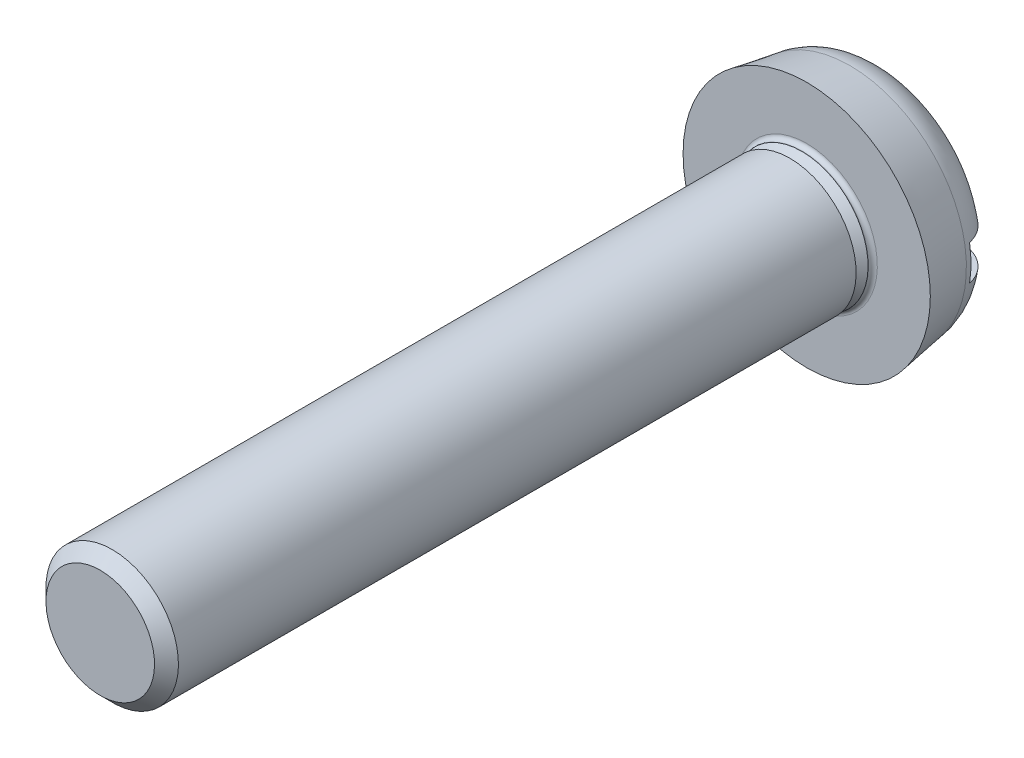
ISO-10303-21;
HEADER;
FILE_DESCRIPTION(('STEP AP214'),'2;1');
FILE_NAME('part.step','',(''),(''),'','','');
FILE_SCHEMA(('AUTOMOTIVE_DESIGN { 1 0 10303 214 1 1 1 1 }'));
ENDSEC;
DATA;
#1=APPLICATION_CONTEXT('core data for automotive mechanical design processes');
#2=APPLICATION_PROTOCOL_DEFINITION('international standard','automotive_design',2000,#1);
#3=PRODUCT_CONTEXT('',#1,'mechanical');
#4=PRODUCT('Part','Part','',(#3));
#5=PRODUCT_RELATED_PRODUCT_CATEGORY('part','',(#4));
#6=PRODUCT_DEFINITION_FORMATION('','',#4);
#7=PRODUCT_DEFINITION_CONTEXT('part definition',#1,'design');
#8=PRODUCT_DEFINITION('design','',#6,#7);
#9=PRODUCT_DEFINITION_SHAPE('','',#8);
#10=(LENGTH_UNIT() NAMED_UNIT(*) SI_UNIT(.MILLI.,.METRE.));
#11=(NAMED_UNIT(*) PLANE_ANGLE_UNIT() SI_UNIT($,.RADIAN.));
#12=(NAMED_UNIT(*) SI_UNIT($,.STERADIAN.) SOLID_ANGLE_UNIT());
#13=UNCERTAINTY_MEASURE_WITH_UNIT(LENGTH_MEASURE(1.E-05),#10,'distance_accuracy_value','');
#14=(GEOMETRIC_REPRESENTATION_CONTEXT(3) GLOBAL_UNCERTAINTY_ASSIGNED_CONTEXT((#13)) GLOBAL_UNIT_ASSIGNED_CONTEXT((#10,
#11,#12)) REPRESENTATION_CONTEXT('',''));
#15=CARTESIAN_POINT('',(0.,0.,0.));
#16=DIRECTION('',(0.,0.,1.));
#17=DIRECTION('',(1.,0.,0.));
#18=AXIS2_PLACEMENT_3D('',#15,#16,#17);
#19=CARTESIAN_POINT('',(0.,0.6146875,17.8));
#20=DIRECTION('',(0.,0.,1.));
#21=DIRECTION('',(0.,1.,0.));
#22=AXIS2_PLACEMENT_3D('',#19,#20,#21);
#23=PLANE('',#22);
#24=CARTESIAN_POINT('',(0.,0.,17.8));
#25=DIRECTION('',(0.,0.,1.));
#26=DIRECTION('',(0.,1.,0.));
#27=AXIS2_PLACEMENT_3D('',#24,#25,#26);
#28=CIRCLE('',#27,1.229375);
#29=CARTESIAN_POINT('',(0.,1.229375,17.8));
#30=VERTEX_POINT('',#29);
#31=EDGE_CURVE('E11',#30,#30,#28,.T.);
#32=ORIENTED_EDGE('',*,*,#31,.T.);
#33=EDGE_LOOP('',(#32));
#34=FACE_BOUND('',#33,.T.);
#35=ADVANCED_FACE('F16',(#34),#23,.T.);
#36=CARTESIAN_POINT('',(0.,0.,17.6646875));
#37=DIRECTION('',(0.,0.,-1.));
#38=DIRECTION('',(0.,1.,0.));
#39=AXIS2_PLACEMENT_3D('',#36,#37,#38);
#40=CONICAL_SURFACE('',#39,1.3646875,0.78539816339745);
#41=CARTESIAN_POINT('',(0.,0.,17.529375));
#42=DIRECTION('',(0.,0.,1.));
#43=DIRECTION('',(0.,1.,0.));
#44=AXIS2_PLACEMENT_3D('',#41,#42,#43);
#45=CIRCLE('',#44,1.5);
#46=CARTESIAN_POINT('',(0.,1.5,17.529375));
#47=VERTEX_POINT('',#46);
#48=EDGE_CURVE('E28',#47,#47,#45,.T.);
#49=ORIENTED_EDGE('',*,*,#48,.T.);
#50=EDGE_LOOP('',(#49));
#51=FACE_BOUND('',#50,.T.);
#52=ORIENTED_EDGE('',*,*,#31,.F.);
#53=EDGE_LOOP('',(#52));
#54=FACE_BOUND('',#53,.T.);
#55=ADVANCED_FACE('F177',(#51,#54),#40,.T.);
#56=CARTESIAN_POINT('',(0.,0.,9.855));
#57=DIRECTION('',(0.,0.,-1.));
#58=DIRECTION('',(0.,1.,0.));
#59=AXIS2_PLACEMENT_3D('',#56,#57,#58);
#60=CYLINDRICAL_SURFACE('',#59,1.5);
#61=CARTESIAN_POINT('',(0.,0.,2.180625));
#62=DIRECTION('',(0.,0.,1.));
#63=DIRECTION('',(0.,1.,0.));
#64=AXIS2_PLACEMENT_3D('',#61,#62,#63);
#65=CIRCLE('',#64,1.5);
#66=CARTESIAN_POINT('',(0.,1.5,2.180625));
#67=VERTEX_POINT('',#66);
#68=EDGE_CURVE('E71',#67,#67,#65,.T.);
#69=ORIENTED_EDGE('',*,*,#68,.T.);
#70=EDGE_LOOP('',(#69));
#71=FACE_BOUND('',#70,.T.);
#72=ORIENTED_EDGE('',*,*,#48,.F.);
#73=EDGE_LOOP('',(#72));
#74=FACE_BOUND('',#73,.T.);
#75=ADVANCED_FACE('F72',(#71,#74),#60,.T.);
#76=CARTESIAN_POINT('',(0.,1.3646875,2.180625));
#77=DIRECTION('',(0.,0.,-1.));
#78=DIRECTION('',(0.,-1.,0.));
#79=AXIS2_PLACEMENT_3D('',#76,#77,#78);
#80=PLANE('',#79);
#81=CARTESIAN_POINT('',(0.,0.,2.180625));
#82=DIRECTION('',(0.,0.,1.));
#83=DIRECTION('',(0.,1.,0.));
#84=AXIS2_PLACEMENT_3D('',#81,#82,#83);
#85=CIRCLE('',#84,1.229375);
#86=CARTESIAN_POINT('',(0.,1.229375,2.180625));
#87=VERTEX_POINT('',#86);
#88=EDGE_CURVE('E75',#87,#87,#85,.T.);
#89=ORIENTED_EDGE('',*,*,#88,.T.);
#90=EDGE_LOOP('',(#89));
#91=FACE_BOUND('',#90,.T.);
#92=ORIENTED_EDGE('',*,*,#68,.F.);
#93=EDGE_LOOP('',(#92));
#94=FACE_BOUND('',#93,.T.);
#95=ADVANCED_FACE('F129',(#91,#94),#80,.T.);
#96=CARTESIAN_POINT('',(0.,0.,2.0453125));
#97=DIRECTION('',(0.,0.,-1.));
#98=DIRECTION('',(0.,1.,0.));
#99=AXIS2_PLACEMENT_3D('',#96,#97,#98);
#100=CONICAL_SURFACE('',#99,1.3646875,0.785398163397448);
#101=CARTESIAN_POINT('',(0.,0.,1.91));
#102=DIRECTION('',(0.,0.,1.));
#103=DIRECTION('',(0.,1.,0.));
#104=AXIS2_PLACEMENT_3D('',#101,#102,#103);
#105=CIRCLE('',#104,1.5);
#106=CARTESIAN_POINT('',(0.,1.5,1.91));
#107=VERTEX_POINT('',#106);
#108=EDGE_CURVE('E78',#107,#107,#105,.T.);
#109=ORIENTED_EDGE('',*,*,#108,.T.);
#110=EDGE_LOOP('',(#109));
#111=FACE_BOUND('',#110,.T.);
#112=ORIENTED_EDGE('',*,*,#88,.F.);
#113=EDGE_LOOP('',(#112));
#114=FACE_BOUND('',#113,.T.);
#115=ADVANCED_FACE('F175',(#111,#114),#100,.T.);
#116=CARTESIAN_POINT('',(0.,0.,1.905));
#117=DIRECTION('',(0.,0.,-1.));
#118=DIRECTION('',(0.,1.,0.));
#119=AXIS2_PLACEMENT_3D('',#116,#117,#118);
#120=CYLINDRICAL_SURFACE('',#119,1.5);
#121=CARTESIAN_POINT('',(0.,0.,1.9));
#122=DIRECTION('',(0.,0.,1.));
#123=DIRECTION('',(0.,1.,0.));
#124=AXIS2_PLACEMENT_3D('',#121,#122,#123);
#125=CIRCLE('',#124,1.5);
#126=CARTESIAN_POINT('',(0.,1.5,1.9));
#127=VERTEX_POINT('',#126);
#128=EDGE_CURVE('E82',#127,#127,#125,.T.);
#129=ORIENTED_EDGE('',*,*,#128,.T.);
#130=EDGE_LOOP('',(#129));
#131=FACE_BOUND('',#130,.T.);
#132=ORIENTED_EDGE('',*,*,#108,.F.);
#133=EDGE_LOOP('',(#132));
#134=FACE_BOUND('',#133,.T.);
#135=ADVANCED_FACE('F170',(#131,#134),#120,.T.);
#136=CARTESIAN_POINT('',(0.,0.,1.9));
#137=DIRECTION('',(0.,0.,1.));
#138=DIRECTION('',(1.,0.,0.));
#139=AXIS2_PLACEMENT_3D('',#136,#137,#138);
#140=TOROIDAL_SURFACE('',#139,1.6,0.1);
#141=CARTESIAN_POINT('',(0.,0.,1.8));
#142=DIRECTION('',(0.,0.,1.));
#143=DIRECTION('',(0.,1.,0.));
#144=AXIS2_PLACEMENT_3D('',#141,#142,#143);
#145=CIRCLE('',#144,1.6);
#146=CARTESIAN_POINT('',(0.,1.6,1.8));
#147=VERTEX_POINT('',#146);
#148=EDGE_CURVE('E250',#147,#147,#145,.T.);
#149=ORIENTED_EDGE('',*,*,#148,.T.);
#150=EDGE_LOOP('',(#149));
#151=FACE_BOUND('',#150,.T.);
#152=ORIENTED_EDGE('',*,*,#128,.F.);
#153=EDGE_LOOP('',(#152));
#154=FACE_BOUND('',#153,.T.);
#155=ADVANCED_FACE('F174',(#151,#154),#140,.F.);
#156=CARTESIAN_POINT('',(0.,2.2,1.8));
#157=DIRECTION('',(0.,0.,1.));
#158=DIRECTION('',(0.,1.,0.));
#159=AXIS2_PLACEMENT_3D('',#156,#157,#158);
#160=PLANE('',#159);
#161=CARTESIAN_POINT('',(0.,0.,1.8));
#162=DIRECTION('',(0.,0.,1.));
#163=DIRECTION('',(0.,1.,0.));
#164=AXIS2_PLACEMENT_3D('',#161,#162,#163);
#165=CIRCLE('',#164,2.8);
#166=CARTESIAN_POINT('',(0.,2.8,1.8));
#167=VERTEX_POINT('',#166);
#168=EDGE_CURVE('E249',#167,#167,#165,.T.);
#169=ORIENTED_EDGE('',*,*,#168,.T.);
#170=EDGE_LOOP('',(#169));
#171=FACE_BOUND('',#170,.T.);
#172=ORIENTED_EDGE('',*,*,#148,.F.);
#173=EDGE_LOOP('',(#172));
#174=FACE_BOUND('',#173,.T.);
#175=ADVANCED_FACE('F229',(#171,#174),#160,.T.);
#176=CARTESIAN_POINT('',(0.,0.,1.31077991576355));
#177=DIRECTION('',(0.,0.,1.));
#178=DIRECTION('',(0.,1.,0.));
#179=AXIS2_PLACEMENT_3D('',#176,#177,#178);
#180=CONICAL_SURFACE('',#179,2.71954781696795,0.162991029402412);
#181=CARTESIAN_POINT('',(0.,0.,0.821559831527108));
#182=DIRECTION('',(0.,0.,1.));
#183=DIRECTION('',(0.,1.,0.));
#184=AXIS2_PLACEMENT_3D('',#181,#182,#183);
#185=CIRCLE('',#184,2.63909563393591);
#186=CARTESIAN_POINT('',(0.,2.63909563393591,0.821559831527108));
#187=VERTEX_POINT('',#186);
#188=EDGE_CURVE('E209',#187,#187,#185,.T.);
#189=ORIENTED_EDGE('',*,*,#188,.T.);
#190=EDGE_LOOP('',(#189));
#191=FACE_BOUND('',#190,.T.);
#192=ORIENTED_EDGE('',*,*,#168,.F.);
#193=EDGE_LOOP('',(#192));
#194=FACE_BOUND('',#193,.T.);
#195=ADVANCED_FACE('F233',(#191,#194),#180,.T.);
#196=CARTESIAN_POINT('',(0.,0.871260202826668,0.));
#197=DIRECTION('',(0.,0.,-1.));
#198=DIRECTION('',(0.,-1.,0.));
#199=AXIS2_PLACEMENT_3D('',#196,#197,#198);
#200=PLANE('',#199);
#201=DIRECTION('',(1.,0.,0.));
#202=VECTOR('',#201,1.);
#203=CARTESIAN_POINT('',(0.,-0.4,0.));
#204=LINE('',#203,#202);
#205=CARTESIAN_POINT('',(-1.69598860966643,-0.4,0.));
#206=VERTEX_POINT('',#205);
#207=CARTESIAN_POINT('',(1.69598860966643,-0.4,0.));
#208=VERTEX_POINT('',#207);
#209=EDGE_CURVE('E202',#206,#208,#204,.T.);
#210=ORIENTED_EDGE('',*,*,#209,.T.);
#211=CARTESIAN_POINT('',(0.,0.,0.));
#212=DIRECTION('',(0.,0.,1.));
#213=DIRECTION('',(0.,1.,0.));
#214=AXIS2_PLACEMENT_3D('',#211,#212,#213);
#215=CIRCLE('',#214,1.74252040565333);
#216=EDGE_CURVE('E86',#206,#208,#215,.T.);
#217=ORIENTED_EDGE('',*,*,#216,.F.);
#218=EDGE_LOOP('',(#210,#217));
#219=FACE_BOUND('',#218,.T.);
#220=ADVANCED_FACE('F238',(#219),#200,.T.);
#221=CARTESIAN_POINT('',(0.,0.871260202826668,0.));
#222=DIRECTION('',(0.,0.,-1.));
#223=DIRECTION('',(0.,-1.,0.));
#224=AXIS2_PLACEMENT_3D('',#221,#222,#223);
#225=PLANE('',#224);
#226=DIRECTION('',(-1.,0.,0.));
#227=VECTOR('',#226,1.);
#228=CARTESIAN_POINT('',(0.,0.4,0.));
#229=LINE('',#228,#227);
#230=CARTESIAN_POINT('',(1.69598860966643,0.4,0.));
#231=VERTEX_POINT('',#230);
#232=CARTESIAN_POINT('',(-1.69598860966643,0.4,0.));
#233=VERTEX_POINT('',#232);
#234=EDGE_CURVE('E201',#231,#233,#229,.T.);
#235=ORIENTED_EDGE('',*,*,#234,.T.);
#236=CARTESIAN_POINT('',(0.,0.,0.));
#237=DIRECTION('',(0.,0.,1.));
#238=DIRECTION('',(0.,1.,0.));
#239=AXIS2_PLACEMENT_3D('',#236,#237,#238);
#240=CIRCLE('',#239,1.74252040565333);
#241=EDGE_CURVE('E199',#231,#233,#240,.T.);
#242=ORIENTED_EDGE('',*,*,#241,.F.);
#243=EDGE_LOOP('',(#235,#242));
#244=FACE_BOUND('',#243,.T.);
#245=ADVANCED_FACE('F18',(#244),#225,.T.);
#246=CARTESIAN_POINT('',(0.,0.,0.9));
#247=DIRECTION('',(0.,0.,1.));
#248=DIRECTION('',(1.,0.,0.));
#249=AXIS2_PLACEMENT_3D('',#246,#247,#248);
#250=TOROIDAL_SURFACE('',#249,1.74252040565333,0.9);
#251=ORIENTED_EDGE('',*,*,#188,.F.);
#252=EDGE_LOOP('',(#251));
#253=FACE_BOUND('',#252,.T.);
#254=CARTESIAN_POINT('',(-2.58930232459963,-0.400002310663471,0.700000093620661));
#255=CARTESIAN_POINT('',(-2.58603016384791,-0.400004445378837,0.685811851401637));
#256=CARTESIAN_POINT('',(-2.58240980288171,-0.400004404648168,0.671703973825827));
#257=CARTESIAN_POINT('',(-2.57451556003029,-0.400001225895553,0.64379773863432));
#258=CARTESIAN_POINT('',(-2.57024730625734,-0.399998113386262,0.629997788758489));
#259=CARTESIAN_POINT('',(-2.56108386584159,-0.399990072352411,0.602734435759247));
#260=CARTESIAN_POINT('',(-2.55619414715188,-0.399985159035877,0.589269194565762));
#261=CARTESIAN_POINT('',(-2.54581566471475,-0.399974533465738,0.562700061286046));
#262=CARTESIAN_POINT('',(-2.54033219664919,-0.399968828164645,0.549594100311867));
#263=CARTESIAN_POINT('',(-2.52879467482801,-0.399957442275121,0.523766294406887));
#264=CARTESIAN_POINT('',(-2.52274573838059,-0.399951761875004,0.51104216325388));
#265=CARTESIAN_POINT('',(-2.51010632936987,-0.399941056241199,0.485998719717618));
#266=CARTESIAN_POINT('',(-2.50352078948981,-0.399936025942421,0.473676917519679));
#267=CARTESIAN_POINT('',(-2.48983764111567,-0.399927077949983,0.449456808761247));
#268=CARTESIAN_POINT('',(-2.48274477581483,-0.39992315130314,0.437555822230551));
#269=CARTESIAN_POINT('',(-2.46807674734359,-0.399916710919099,0.414194025157023));
#270=CARTESIAN_POINT('',(-2.46050613388774,-0.399914185595139,0.402730357692553));
#271=CARTESIAN_POINT('',(-2.44491256052025,-0.399910708739053,0.380257922331634));
#272=CARTESIAN_POINT('',(-2.43689395376447,-0.399909744114387,0.369246133452677));
#273=CARTESIAN_POINT('',(-2.42043441297166,-0.399909427768705,0.347690266360427));
#274=CARTESIAN_POINT('',(-2.41199763325036,-0.399910062450045,0.337143015655555));
#275=CARTESIAN_POINT('',(-2.39473172574231,-0.399912879900166,0.316527173193073));
#276=CARTESIAN_POINT('',(-2.38590655187944,-0.399915049436982,0.306455269621401));
#277=CARTESIAN_POINT('',(-2.36789369411513,-0.39992078558915,0.286799261016866));
#278=CARTESIAN_POINT('',(-2.35870976284898,-0.399924340078451,0.277211716654721));
#279=CARTESIAN_POINT('',(-2.3400089920985,-0.399932626429048,0.258531815521256));
#280=CARTESIAN_POINT('',(-2.33049570365215,-0.3999373478799,0.249435903326361));
#281=CARTESIAN_POINT('',(-2.31116549544524,-0.399947696846867,0.231744966673539));
#282=CARTESIAN_POINT('',(-2.30135192534285,-0.399953316148124,0.223146281732119));
#283=CARTESIAN_POINT('',(-2.28145002336425,-0.39996515447717,0.206453875453827));
#284=CARTESIAN_POINT('',(-2.27136484045451,-0.399971367837367,0.198356399226376));
#285=CARTESIAN_POINT('',(-2.25094809880811,-0.399984068833167,0.182668929108262));
#286=CARTESIAN_POINT('',(-2.24061948945558,-0.39999055357373,0.175075096200253));
#287=CARTESIAN_POINT('',(-2.21974372718398,-0.400003467933913,0.160395943523096));
#288=CARTESIAN_POINT('',(-2.20919932555431,-0.400009897532228,0.15330671052952));
#289=CARTESIAN_POINT('',(-2.18791919324446,-0.400022382591445,0.139636371387922));
#290=CARTESIAN_POINT('',(-2.17718601758761,-0.400028440884483,0.133051287381121));
#291=CARTESIAN_POINT('',(-2.15555487584855,-0.400039888103823,0.120387514879533));
#292=CARTESIAN_POINT('',(-2.14465927066184,-0.400045282576831,0.114304793131935));
#293=CARTESIAN_POINT('',(-2.12272908021936,-0.400055143141028,0.102642741664363));
#294=CARTESIAN_POINT('',(-2.11169666415282,-0.400059617239203,0.0970593322200856));
#295=CARTESIAN_POINT('',(-2.08951788726964,-0.40006742565004,0.0863917030851215));
#296=CARTESIAN_POINT('',(-2.07837350661909,-0.400070770063668,0.0813033658174739));
#297=CARTESIAN_POINT('',(-2.0559950195168,-0.400076165642902,0.0716205534654186));
#298=CARTESIAN_POINT('',(-2.04476270713511,-0.4000782285288,0.0670219312795501));
#299=CARTESIAN_POINT('',(-2.02223172306731,-0.400080974766746,0.0583121695365562));
#300=CARTESIAN_POINT('',(-2.01093466251196,-0.400081670879314,0.0541968614025229));
#301=CARTESIAN_POINT('',(-1.98829666511221,-0.400081672589585,0.0464463690545487));
#302=CARTESIAN_POINT('',(-1.97695715983429,-0.400080991308666,0.0428070025681866));
#303=CARTESIAN_POINT('',(-1.95425584634926,-0.400078309561493,0.0360001277627895));
#304=CARTESIAN_POINT('',(-1.94289529372838,-0.400076321802372,0.0328284309945193));
#305=CARTESIAN_POINT('',(-1.92017252770733,-0.400071186659841,0.0269477938547178));
#306=CARTESIAN_POINT('',(-1.90881139769879,-0.400068050703004,0.0242346661217626));
#307=CARTESIAN_POINT('',(-1.88610717078177,-0.400060871679835,0.0192612994111576));
#308=CARTESIAN_POINT('',(-1.87476498905065,-0.40005683780804,0.016996881171664));
#309=CARTESIAN_POINT('',(-1.85211739117859,-0.400048212428999,0.0129103674199857));
#310=CARTESIAN_POINT('',(-1.84081272617266,-0.400043626849462,0.0110841075194339));
#311=CARTESIAN_POINT('',(-1.81825792467539,-0.400034346102312,0.00786271647858093));
#312=CARTESIAN_POINT('',(-1.80700837962538,-0.400029652496472,0.00646344231543007));
#313=CARTESIAN_POINT('',(-1.78458060344841,-0.400020707826365,0.00408425273403898));
#314=CARTESIAN_POINT('',(-1.77340280862478,-0.400016452751234,0.00310022203710451));
#315=CARTESIAN_POINT('',(-1.75113434936234,-0.400009027807287,0.00153928502228685));
#316=CARTESIAN_POINT('',(-1.74004397071413,-0.400005847230545,0.000958296807314361));
#317=CARTESIAN_POINT('',(-1.71796515548473,-0.400001356412844,0.000190628883216523));
#318=CARTESIAN_POINT('',(-1.70697685936081,-0.400000027048728,-9.21157266769306E-08));
#319=CARTESIAN_POINT('',(-1.69598860966643,-0.399999999999999,0.));
#320=B_SPLINE_CURVE_WITH_KNOTS('',3,(#254,#255,#256,#257,#258,#259,#260,#261,#262,#263,#264,
#265,#266,#267,#268,#269,#270,#271,#272,#273,#274,#275,#276,#277,#278,#279,#280,#281,#282,#283,
#284,#285,#286,#287,#288,#289,#290,#291,#292,#293,#294,#295,#296,#297,#298,#299,#300,#301,#302,
#303,#304,#305,#306,#307,#308,#309,#310,#311,#312,#313,#314,#315,#316,#317,#318,#319),
.UNSPECIFIED.,.F.,.F.,(4,2,2,2,2,2,2,2,2,2,2,2,2,2,2,2,2,2,2,2,2,2,2,2,2,2,2,2,2,2,2,2,4),(0.,
0.0436775543026024,0.0869953717705489,0.129955491214729,0.172559878286484,0.214810411285361,
0.256708868530925,0.298256917378994,0.339456104934224,0.380307850483672,0.420813439650351,
0.460974020242027,0.500790599749031,0.540264044425763,0.579395079873997,0.618184293032249,
0.65663213546411,0.694738927829809,0.732504865419087,0.769930024619608,0.807014370193588,
0.843757763235705,0.880159969687621,0.916220669288302,0.95193946484455,0.987315891712556,
1.02234942738864,1.05703950111545,1.09138550341838,1.12538679549621,1.15904271839879,
1.19235260193416,1.22531577325621),.UNSPECIFIED.);
#321=CARTESIAN_POINT('',(-2.58930265996478,-0.4,0.7));
#322=VERTEX_POINT('',#321);
#323=EDGE_CURVE('E100',#322,#206,#320,.T.);
#324=ORIENTED_EDGE('',*,*,#323,.T.);
#325=ORIENTED_EDGE('',*,*,#216,.T.);
#326=CARTESIAN_POINT('',(1.69598860966643,-0.400000000000007,0.));
#327=CARTESIAN_POINT('',(1.7069768593608,-0.400000027048737,-9.21157268844622E-08));
#328=CARTESIAN_POINT('',(1.71796515548472,-0.400001356412853,0.000190628883216311));
#329=CARTESIAN_POINT('',(1.74004397071413,-0.400005847230553,0.00095829680731414));
#330=CARTESIAN_POINT('',(1.75113434936234,-0.400009027807294,0.00153928502228663));
#331=CARTESIAN_POINT('',(1.77340280862478,-0.400016452751241,0.0031002220371043));
#332=CARTESIAN_POINT('',(1.78458060344841,-0.400020707826373,0.00408425273403877));
#333=CARTESIAN_POINT('',(1.80700837962537,-0.40002965249648,0.00646344231542986));
#334=CARTESIAN_POINT('',(1.81825792467538,-0.40003434610232,0.00786271647858071));
#335=CARTESIAN_POINT('',(1.84081272617266,-0.40004362684947,0.0110841075194337));
#336=CARTESIAN_POINT('',(1.85211739117859,-0.400048212429007,0.0129103674199854));
#337=CARTESIAN_POINT('',(1.87476498905064,-0.400056837808047,0.0169968811716638));
#338=CARTESIAN_POINT('',(1.88610717078176,-0.400060871679843,0.0192612994111574));
#339=CARTESIAN_POINT('',(1.90881139769879,-0.400068050703011,0.0242346661217624));
#340=CARTESIAN_POINT('',(1.92017252770733,-0.400071186659847,0.0269477938547176));
#341=CARTESIAN_POINT('',(1.94289529372838,-0.400076321802378,0.032828430994519));
#342=CARTESIAN_POINT('',(1.95425584634926,-0.400078309561499,0.0360001277627893));
#343=CARTESIAN_POINT('',(1.97695715983428,-0.400080991308672,0.0428070025681864));
#344=CARTESIAN_POINT('',(1.9882966651122,-0.400081672589591,0.0464463690545485));
#345=CARTESIAN_POINT('',(2.01093466251196,-0.40008167087932,0.0541968614025227));
#346=CARTESIAN_POINT('',(2.02223172306731,-0.400080974766751,0.058312169536556));
#347=CARTESIAN_POINT('',(2.04476270713511,-0.400078228528805,0.0670219312795498));
#348=CARTESIAN_POINT('',(2.0559950195168,-0.400076165642908,0.0716205534654184));
#349=CARTESIAN_POINT('',(2.07837350661909,-0.400070770063674,0.0813033658174737));
#350=CARTESIAN_POINT('',(2.08951788726963,-0.400067425650045,0.0863917030851213));
#351=CARTESIAN_POINT('',(2.11169666415282,-0.400059617239208,0.0970593322200853));
#352=CARTESIAN_POINT('',(2.12272908021936,-0.400055143141032,0.102642741664363));
#353=CARTESIAN_POINT('',(2.14465927066184,-0.400045282576835,0.114304793131934));
#354=CARTESIAN_POINT('',(2.15555487584855,-0.400039888103828,0.120387514879533));
#355=CARTESIAN_POINT('',(2.17718601758761,-0.400028440884488,0.133051287381121));
#356=CARTESIAN_POINT('',(2.18791919324446,-0.40002238259145,0.139636371387922));
#357=CARTESIAN_POINT('',(2.20919932555431,-0.400009897532232,0.15330671052952));
#358=CARTESIAN_POINT('',(2.21974372718398,-0.400003467933917,0.160395943523096));
#359=CARTESIAN_POINT('',(2.24061948945558,-0.399990553573736,0.175075096200253));
#360=CARTESIAN_POINT('',(2.2509480988081,-0.399984068833175,0.182668929108262));
#361=CARTESIAN_POINT('',(2.27136484045451,-0.399971367837374,0.198356399226376));
#362=CARTESIAN_POINT('',(2.28145002336425,-0.399965154477175,0.206453875453827));
#363=CARTESIAN_POINT('',(2.30135192534285,-0.399953316148127,0.223146281732119));
#364=CARTESIAN_POINT('',(2.31116549544524,-0.399947696846872,0.231744966673539));
#365=CARTESIAN_POINT('',(2.33049570365215,-0.399937347879907,0.249435903326361));
#366=CARTESIAN_POINT('',(2.3400089920985,-0.399932626429057,0.258531815521256));
#367=CARTESIAN_POINT('',(2.35870976284897,-0.399924340078459,0.277211716654721));
#368=CARTESIAN_POINT('',(2.36789369411513,-0.399920785589157,0.286799261016866));
#369=CARTESIAN_POINT('',(2.38590655187944,-0.39991504943699,0.306455269621401));
#370=CARTESIAN_POINT('',(2.39473172574231,-0.399912879900176,0.316527173193073));
#371=CARTESIAN_POINT('',(2.41199763325036,-0.399910062450054,0.337143015655555));
#372=CARTESIAN_POINT('',(2.42043441297166,-0.399909427768711,0.347690266360427));
#373=CARTESIAN_POINT('',(2.43689395376447,-0.399909744114391,0.369246133452677));
#374=CARTESIAN_POINT('',(2.44491256052025,-0.39991070873906,0.380257922331634));
#375=CARTESIAN_POINT('',(2.46050613388774,-0.399914185595149,0.402730357692553));
#376=CARTESIAN_POINT('',(2.46807674734359,-0.39991671091911,0.414194025157023));
#377=CARTESIAN_POINT('',(2.48274477581483,-0.399923151303151,0.437555822230551));
#378=CARTESIAN_POINT('',(2.48983764111567,-0.399927077949994,0.449456808761247));
#379=CARTESIAN_POINT('',(2.5035207894898,-0.399936025942431,0.473676917519679));
#380=CARTESIAN_POINT('',(2.51010632936987,-0.399941056241208,0.485998719717618));
#381=CARTESIAN_POINT('',(2.52274573838059,-0.399951761875014,0.51104216325388));
#382=CARTESIAN_POINT('',(2.52879467482801,-0.399957442275131,0.523766294406887));
#383=CARTESIAN_POINT('',(2.54033219664918,-0.399968828164654,0.549594100311867));
#384=CARTESIAN_POINT('',(2.54581566471475,-0.399974533465747,0.562700061286046));
#385=CARTESIAN_POINT('',(2.55619414715187,-0.399985159035886,0.589269194565761));
#386=CARTESIAN_POINT('',(2.56108386584158,-0.399990072352421,0.602734435759247));
#387=CARTESIAN_POINT('',(2.57024730625733,-0.399998113386274,0.62999778875849));
#388=CARTESIAN_POINT('',(2.57451556003029,-0.400001225895564,0.64379773863432));
#389=CARTESIAN_POINT('',(2.58240980288171,-0.40000440464818,0.671703973825827));
#390=CARTESIAN_POINT('',(2.58603016384791,-0.400004445378848,0.685811851401637));
#391=CARTESIAN_POINT('',(2.58930232459963,-0.400002310663485,0.700000093620661));
#392=B_SPLINE_CURVE_WITH_KNOTS('',3,(#326,#327,#328,#329,#330,#331,#332,#333,#334,#335,#336,
#337,#338,#339,#340,#341,#342,#343,#344,#345,#346,#347,#348,#349,#350,#351,#352,#353,#354,#355,
#356,#357,#358,#359,#360,#361,#362,#363,#364,#365,#366,#367,#368,#369,#370,#371,#372,#373,#374,
#375,#376,#377,#378,#379,#380,#381,#382,#383,#384,#385,#386,#387,#388,#389,#390,#391),
.UNSPECIFIED.,.F.,.F.,(4,2,2,2,2,2,2,2,2,2,2,2,2,2,2,2,2,2,2,2,2,2,2,2,2,2,2,2,2,2,2,2,4),(0.,
0.0329631713220495,0.0662730548574191,0.0999289777600034,0.133930269837828,0.168276272140758,
0.202966345867566,0.237999881543655,0.273376308411661,0.309095103967909,0.34515580356859,
0.381558010020506,0.418301403062623,0.455385748636604,0.492810907837125,0.530576845426402,
0.568683637792101,0.607131480223962,0.645920693382215,0.685051728830449,0.724525173507179,
0.764341753014185,0.80450233360586,0.845007922772539,0.885859668321987,0.927058855877217,
0.968606904725287,1.01050536197085,1.05275589496973,1.09536028204148,1.13832040148566,
1.18163821895361,1.22531577325621),.UNSPECIFIED.);
#393=CARTESIAN_POINT('',(2.58930265996478,-0.4,0.7));
#394=VERTEX_POINT('',#393);
#395=EDGE_CURVE('E99',#208,#394,#392,.T.);
#396=ORIENTED_EDGE('',*,*,#395,.T.);
#397=CARTESIAN_POINT('',(0.,0.,0.7));
#398=DIRECTION('',(0.,0.,1.));
#399=DIRECTION('',(1.,0.,0.));
#400=AXIS2_PLACEMENT_3D('',#397,#398,#399);
#401=CIRCLE('',#400,2.62001684439255);
#402=CARTESIAN_POINT('',(2.58930265996478,0.4,0.7));
#403=VERTEX_POINT('',#402);
#404=EDGE_CURVE('E83',#394,#403,#401,.T.);
#405=ORIENTED_EDGE('',*,*,#404,.T.);
#406=CARTESIAN_POINT('',(2.58930232459963,0.400002310663471,0.700000093620661));
#407=CARTESIAN_POINT('',(2.58603016384791,0.400004445378836,0.685811851401637));
#408=CARTESIAN_POINT('',(2.58240980288171,0.400004404648167,0.671703973825827));
#409=CARTESIAN_POINT('',(2.57451556003029,0.400001225895552,0.64379773863432));
#410=CARTESIAN_POINT('',(2.57024730625734,0.399998113386261,0.629997788758489));
#411=CARTESIAN_POINT('',(2.56108386584159,0.399990072352409,0.602734435759247));
#412=CARTESIAN_POINT('',(2.55619414715188,0.399985159035874,0.589269194565761));
#413=CARTESIAN_POINT('',(2.54581566471475,0.399974533465736,0.562700061286045));
#414=CARTESIAN_POINT('',(2.54033219664919,0.399968828164644,0.549594100311866));
#415=CARTESIAN_POINT('',(2.52879467482801,0.399957442275121,0.523766294406886));
#416=CARTESIAN_POINT('',(2.52274573838059,0.399951761875004,0.511042163253879));
#417=CARTESIAN_POINT('',(2.51010632936987,0.399941056241198,0.485998719717617));
#418=CARTESIAN_POINT('',(2.50352078948981,0.39993602594242,0.473676917519679));
#419=CARTESIAN_POINT('',(2.48983764111567,0.399927077949982,0.449456808761247));
#420=CARTESIAN_POINT('',(2.48274477581483,0.399923151303139,0.43755582223055));
#421=CARTESIAN_POINT('',(2.46807674734359,0.399916710919098,0.414194025157023));
#422=CARTESIAN_POINT('',(2.46050613388774,0.399914185595137,0.402730357692553));
#423=CARTESIAN_POINT('',(2.44491256052025,0.399910708739051,0.380257922331633));
#424=CARTESIAN_POINT('',(2.43689395376447,0.399909744114385,0.369246133452676));
#425=CARTESIAN_POINT('',(2.42043441297166,0.399909427768703,0.347690266360427));
#426=CARTESIAN_POINT('',(2.41199763325036,0.399910062450044,0.337143015655554));
#427=CARTESIAN_POINT('',(2.39473172574231,0.399912879900164,0.316527173193073));
#428=CARTESIAN_POINT('',(2.38590655187944,0.39991504943698,0.3064552696214));
#429=CARTESIAN_POINT('',(2.36789369411513,0.399920785589148,0.286799261016865));
#430=CARTESIAN_POINT('',(2.35870976284897,0.399924340078449,0.27721171665472));
#431=CARTESIAN_POINT('',(2.3400089920985,0.399932626429047,0.258531815521256));
#432=CARTESIAN_POINT('',(2.33049570365215,0.399937347879898,0.24943590332636));
#433=CARTESIAN_POINT('',(2.31116549544524,0.399947696846865,0.231744966673538));
#434=CARTESIAN_POINT('',(2.30135192534285,0.399953316148122,0.223146281732119));
#435=CARTESIAN_POINT('',(2.28145002336425,0.399965154477168,0.206453875453827));
#436=CARTESIAN_POINT('',(2.27136484045451,0.399971367837365,0.198356399226375));
#437=CARTESIAN_POINT('',(2.25094809880811,0.399984068833166,0.182668929108261));
#438=CARTESIAN_POINT('',(2.24061948945558,0.399990553573728,0.175075096200253));
#439=CARTESIAN_POINT('',(2.21974372718398,0.400003467933911,0.160395943523096));
#440=CARTESIAN_POINT('',(2.20919932555431,0.400009897532227,0.15330671052952));
#441=CARTESIAN_POINT('',(2.18791919324446,0.400022382591444,0.139636371387921));
#442=CARTESIAN_POINT('',(2.17718601758761,0.400028440884481,0.13305128738112));
#443=CARTESIAN_POINT('',(2.15555487584855,0.400039888103821,0.120387514879533));
#444=CARTESIAN_POINT('',(2.14465927066184,0.400045282576829,0.114304793131934));
#445=CARTESIAN_POINT('',(2.12272908021936,0.400055143141026,0.102642741664363));
#446=CARTESIAN_POINT('',(2.11169666415282,0.400059617239201,0.0970593322200851));
#447=CARTESIAN_POINT('',(2.08951788726963,0.400067425650038,0.0863917030851211));
#448=CARTESIAN_POINT('',(2.07837350661909,0.400070770063668,0.0813033658174735));
#449=CARTESIAN_POINT('',(2.0559950195168,0.400076165642902,0.0716205534654181));
#450=CARTESIAN_POINT('',(2.04476270713511,0.400078228528799,0.0670219312795495));
#451=CARTESIAN_POINT('',(2.02223172306731,0.400080974766744,0.0583121695365557));
#452=CARTESIAN_POINT('',(2.01093466251196,0.400081670879313,0.0541968614025224));
#453=CARTESIAN_POINT('',(1.9882966651122,0.400081672589584,0.0464463690545483));
#454=CARTESIAN_POINT('',(1.97695715983428,0.400080991308665,0.0428070025681861));
#455=CARTESIAN_POINT('',(1.95425584634926,0.400078309561492,0.036000127762789));
#456=CARTESIAN_POINT('',(1.94289529372838,0.400076321802372,0.0328284309945189));
#457=CARTESIAN_POINT('',(1.92017252770733,0.400071186659841,0.0269477938547175));
#458=CARTESIAN_POINT('',(1.90881139769879,0.400068050703003,0.0242346661217623));
#459=CARTESIAN_POINT('',(1.88610717078177,0.400060871679835,0.0192612994111573));
#460=CARTESIAN_POINT('',(1.87476498905064,0.40005683780804,0.0169968811716638));
#461=CARTESIAN_POINT('',(1.85211739117859,0.400048212429,0.0129103674199854));
#462=CARTESIAN_POINT('',(1.84081272617266,0.400043626849463,0.0110841075194337));
#463=CARTESIAN_POINT('',(1.81825792467539,0.400034346102313,0.00786271647858072));
#464=CARTESIAN_POINT('',(1.80700837962538,0.400029652496473,0.00646344231542984));
#465=CARTESIAN_POINT('',(1.78458060344841,0.400020707826366,0.00408425273403875));
#466=CARTESIAN_POINT('',(1.77340280862478,0.400016452751234,0.0031002220371043));
#467=CARTESIAN_POINT('',(1.75113434936234,0.400009027807287,0.00153928502228665));
#468=CARTESIAN_POINT('',(1.74004397071413,0.400005847230546,0.000958296807314151));
#469=CARTESIAN_POINT('',(1.71796515548472,0.400001356412845,0.00019062888321629));
#470=CARTESIAN_POINT('',(1.70697685936081,0.400000027048729,-9.21157269169518E-08));
#471=CARTESIAN_POINT('',(1.69598860966643,0.4,0.));
#472=B_SPLINE_CURVE_WITH_KNOTS('',3,(#406,#407,#408,#409,#410,#411,#412,#413,#414,#415,#416,
#417,#418,#419,#420,#421,#422,#423,#424,#425,#426,#427,#428,#429,#430,#431,#432,#433,#434,#435,
#436,#437,#438,#439,#440,#441,#442,#443,#444,#445,#446,#447,#448,#449,#450,#451,#452,#453,#454,
#455,#456,#457,#458,#459,#460,#461,#462,#463,#464,#465,#466,#467,#468,#469,#470,#471),
.UNSPECIFIED.,.F.,.F.,(4,2,2,2,2,2,2,2,2,2,2,2,2,2,2,2,2,2,2,2,2,2,2,2,2,2,2,2,2,2,2,2,4),(0.,
0.0436775543026023,0.086995371770549,0.129955491214729,0.172559878286485,0.214810411285362,
0.256708868530925,0.298256917378995,0.339456104934224,0.380307850483673,0.420813439650352,
0.460974020242028,0.500790599749032,0.540264044425763,0.579395079873998,0.618184293032251,
0.656632135464111,0.69473892782981,0.732504865419088,0.769930024619608,0.807014370193589,
0.843757763235706,0.880159969687622,0.916220669288304,0.951939464844551,0.987315891712557,
1.02234942738865,1.05703950111545,1.09138550341838,1.12538679549621,1.15904271839879,
1.19235260193416,1.22531577325621),.UNSPECIFIED.);
#473=EDGE_CURVE('E93',#403,#231,#472,.T.);
#474=ORIENTED_EDGE('',*,*,#473,.T.);
#475=ORIENTED_EDGE('',*,*,#241,.T.);
#476=CARTESIAN_POINT('',(-1.69598860966643,0.400000000000001,0.));
#477=CARTESIAN_POINT('',(-1.70697685936081,0.400000027048731,-9.21157266375822E-08));
#478=CARTESIAN_POINT('',(-1.71796515548472,0.400001356412847,0.000190628883216544));
#479=CARTESIAN_POINT('',(-1.74004397071413,0.400005847230547,0.000958296807314343));
#480=CARTESIAN_POINT('',(-1.75113434936234,0.400009027807288,0.00153928502228682));
#481=CARTESIAN_POINT('',(-1.77340280862478,0.400016452751235,0.00310022203710454));
#482=CARTESIAN_POINT('',(-1.78458060344841,0.400020707826367,0.00408425273403909));
#483=CARTESIAN_POINT('',(-1.80700837962538,0.400029652496474,0.00646344231543017));
#484=CARTESIAN_POINT('',(-1.81825792467539,0.400034346102313,0.00786271647858096));
#485=CARTESIAN_POINT('',(-1.84081272617266,0.400043626849463,0.0110841075194339));
#486=CARTESIAN_POINT('',(-1.85211739117859,0.400048212429001,0.0129103674199857));
#487=CARTESIAN_POINT('',(-1.87476498905065,0.400056837808041,0.0169968811716642));
#488=CARTESIAN_POINT('',(-1.88610717078177,0.400060871679835,0.0192612994111577));
#489=CARTESIAN_POINT('',(-1.90881139769879,0.400068050703003,0.0242346661217628));
#490=CARTESIAN_POINT('',(-1.92017252770733,0.400071186659842,0.026947793854718));
#491=CARTESIAN_POINT('',(-1.94289529372838,0.400076321802373,0.0328284309945195));
#492=CARTESIAN_POINT('',(-1.95425584634926,0.400078309561493,0.0360001277627897));
#493=CARTESIAN_POINT('',(-1.97695715983429,0.400080991308665,0.0428070025681869));
#494=CARTESIAN_POINT('',(-1.98829666511221,0.400081672589584,0.046446369054549));
#495=CARTESIAN_POINT('',(-2.01093466251196,0.400081670879312,0.0541968614025232));
#496=CARTESIAN_POINT('',(-2.02223172306731,0.400080974766743,0.0583121695365564));
#497=CARTESIAN_POINT('',(-2.04476270713512,0.400078228528798,0.0670219312795502));
#498=CARTESIAN_POINT('',(-2.0559950195168,0.400076165642901,0.0716205534654189));
#499=CARTESIAN_POINT('',(-2.07837350661909,0.400070770063668,0.0813033658174743));
#500=CARTESIAN_POINT('',(-2.08951788726964,0.400067425650038,0.0863917030851219));
#501=CARTESIAN_POINT('',(-2.11169666415282,0.400059617239201,0.0970593322200859));
#502=CARTESIAN_POINT('',(-2.12272908021936,0.400055143141026,0.102642741664364));
#503=CARTESIAN_POINT('',(-2.14465927066184,0.400045282576828,0.114304793131935));
#504=CARTESIAN_POINT('',(-2.15555487584855,0.400039888103821,0.120387514879534));
#505=CARTESIAN_POINT('',(-2.17718601758761,0.400028440884481,0.133051287381121));
#506=CARTESIAN_POINT('',(-2.18791919324447,0.400022382591444,0.139636371387923));
#507=CARTESIAN_POINT('',(-2.20919932555431,0.400009897532226,0.153306710529521));
#508=CARTESIAN_POINT('',(-2.21974372718399,0.40000346793391,0.160395943523097));
#509=CARTESIAN_POINT('',(-2.24061948945558,0.399990553573727,0.175075096200254));
#510=CARTESIAN_POINT('',(-2.25094809880811,0.399984068833164,0.182668929108263));
#511=CARTESIAN_POINT('',(-2.27136484045451,0.399971367837365,0.198356399226376));
#512=CARTESIAN_POINT('',(-2.28145002336425,0.399965154477168,0.206453875453828));
#513=CARTESIAN_POINT('',(-2.30135192534285,0.399953316148122,0.22314628173212));
#514=CARTESIAN_POINT('',(-2.31116549544524,0.399947696846865,0.23174496667354));
#515=CARTESIAN_POINT('',(-2.33049570365215,0.399937347879897,0.249435903326362));
#516=CARTESIAN_POINT('',(-2.3400089920985,0.399932626429046,0.258531815521257));
#517=CARTESIAN_POINT('',(-2.35870976284898,0.399924340078449,0.277211716654722));
#518=CARTESIAN_POINT('',(-2.36789369411513,0.399920785589148,0.286799261016867));
#519=CARTESIAN_POINT('',(-2.38590655187944,0.399915049436981,0.306455269621402));
#520=CARTESIAN_POINT('',(-2.39473172574231,0.399912879900165,0.316527173193074));
#521=CARTESIAN_POINT('',(-2.41199763325036,0.399910062450043,0.337143015655555));
#522=CARTESIAN_POINT('',(-2.42043441297166,0.399909427768702,0.347690266360428));
#523=CARTESIAN_POINT('',(-2.43689395376447,0.399909744114384,0.369246133452677));
#524=CARTESIAN_POINT('',(-2.44491256052025,0.399910708739052,0.380257922331635));
#525=CARTESIAN_POINT('',(-2.46050613388774,0.399914185595139,0.402730357692554));
#526=CARTESIAN_POINT('',(-2.46807674734359,0.399916710919099,0.414194025157024));
#527=CARTESIAN_POINT('',(-2.48274477581483,0.39992315130314,0.437555822230552));
#528=CARTESIAN_POINT('',(-2.48983764111567,0.399927077949984,0.449456808761248));
#529=CARTESIAN_POINT('',(-2.50352078948981,0.399936025942422,0.47367691751968));
#530=CARTESIAN_POINT('',(-2.51010632936987,0.399941056241199,0.485998719717619));
#531=CARTESIAN_POINT('',(-2.52274573838059,0.399951761875005,0.51104216325388));
#532=CARTESIAN_POINT('',(-2.52879467482801,0.399957442275123,0.523766294406888));
#533=CARTESIAN_POINT('',(-2.54033219664919,0.399968828164646,0.549594100311867));
#534=CARTESIAN_POINT('',(-2.54581566471475,0.399974533465738,0.562700061286046));
#535=CARTESIAN_POINT('',(-2.55619414715188,0.399985159035876,0.589269194565762));
#536=CARTESIAN_POINT('',(-2.56108386584159,0.399990072352412,0.602734435759248));
#537=CARTESIAN_POINT('',(-2.57024730625734,0.399998113386264,0.62999778875849));
#538=CARTESIAN_POINT('',(-2.57451556003029,0.400001225895555,0.643797738634321));
#539=CARTESIAN_POINT('',(-2.58240980288171,0.40000440464817,0.671703973825827));
#540=CARTESIAN_POINT('',(-2.58603016384791,0.400004445378839,0.685811851401637));
#541=CARTESIAN_POINT('',(-2.58930232459963,0.400002310663475,0.700000093620661));
#542=B_SPLINE_CURVE_WITH_KNOTS('',3,(#476,#477,#478,#479,#480,#481,#482,#483,#484,#485,#486,
#487,#488,#489,#490,#491,#492,#493,#494,#495,#496,#497,#498,#499,#500,#501,#502,#503,#504,#505,
#506,#507,#508,#509,#510,#511,#512,#513,#514,#515,#516,#517,#518,#519,#520,#521,#522,#523,#524,
#525,#526,#527,#528,#529,#530,#531,#532,#533,#534,#535,#536,#537,#538,#539,#540,#541),
.UNSPECIFIED.,.F.,.F.,(4,2,2,2,2,2,2,2,2,2,2,2,2,2,2,2,2,2,2,2,2,2,2,2,2,2,2,2,2,2,2,2,4),(0.,
0.0329631713220495,0.0662730548574193,0.0999289777600038,0.133930269837828,0.168276272140759,
0.202966345867566,0.237999881543656,0.273376308411661,0.309095103967909,0.34515580356859,
0.381558010020506,0.418301403062624,0.455385748636605,0.492810907837125,0.530576845426403,
0.568683637792102,0.607131480223962,0.645920693382215,0.68505172883045,0.724525173507181,
0.764341753014185,0.804502333605861,0.84500792277254,0.885859668321988,0.927058855877218,
0.968606904725287,1.01050536197085,1.05275589496973,1.09536028204148,1.13832040148566,
1.18163821895361,1.22531577325621),.UNSPECIFIED.);
#543=CARTESIAN_POINT('',(-2.58930265996478,0.4,0.7));
#544=VERTEX_POINT('',#543);
#545=EDGE_CURVE('E198',#233,#544,#542,.T.);
#546=ORIENTED_EDGE('',*,*,#545,.T.);
#547=CARTESIAN_POINT('',(0.,0.,0.7));
#548=DIRECTION('',(0.,0.,1.));
#549=DIRECTION('',(1.,0.,0.));
#550=AXIS2_PLACEMENT_3D('',#547,#548,#549);
#551=CIRCLE('',#550,2.62001684439255);
#552=EDGE_CURVE('E87',#544,#322,#551,.T.);
#553=ORIENTED_EDGE('',*,*,#552,.T.);
#554=EDGE_LOOP('',(#324,#325,#396,#405,#474,#475,#546,#553));
#555=FACE_BOUND('',#554,.T.);
#556=ADVANCED_FACE('F117',(#253,#555),#250,.T.);
#557=CARTESIAN_POINT('',(0.,0.,0.7));
#558=DIRECTION('',(0.,0.,-1.));
#559=DIRECTION('',(-1.,0.,0.));
#560=AXIS2_PLACEMENT_3D('',#557,#558,#559);
#561=PLANE('',#560);
#562=ORIENTED_EDGE('',*,*,#552,.F.);
#563=DIRECTION('',(1.,0.,0.));
#564=VECTOR('',#563,1.);
#565=CARTESIAN_POINT('',(0.,0.4,0.7));
#566=LINE('',#565,#564);
#567=EDGE_CURVE('E90',#544,#403,#566,.T.);
#568=ORIENTED_EDGE('',*,*,#567,.T.);
#569=ORIENTED_EDGE('',*,*,#404,.F.);
#570=DIRECTION('',(1.,0.,0.));
#571=VECTOR('',#570,1.);
#572=CARTESIAN_POINT('',(0.,-0.4,0.7));
#573=LINE('',#572,#571);
#574=EDGE_CURVE('E96',#322,#394,#573,.T.);
#575=ORIENTED_EDGE('',*,*,#574,.F.);
#576=EDGE_LOOP('',(#562,#568,#569,#575));
#577=FACE_BOUND('',#576,.T.);
#578=ADVANCED_FACE('F127',(#577),#561,.T.);
#579=CARTESIAN_POINT('',(0.,0.4,-0.15));
#580=DIRECTION('',(0.,-1.,0.));
#581=DIRECTION('',(1.,0.,0.));
#582=AXIS2_PLACEMENT_3D('',#579,#580,#581);
#583=PLANE('',#582);
#584=ORIENTED_EDGE('',*,*,#545,.F.);
#585=ORIENTED_EDGE('',*,*,#234,.F.);
#586=ORIENTED_EDGE('',*,*,#473,.F.);
#587=ORIENTED_EDGE('',*,*,#567,.F.);
#588=EDGE_LOOP('',(#584,#585,#586,#587));
#589=FACE_BOUND('',#588,.T.);
#590=ADVANCED_FACE('F169',(#589),#583,.T.);
#591=CARTESIAN_POINT('',(0.,-0.4,-0.15));
#592=DIRECTION('',(0.,1.,0.));
#593=DIRECTION('',(-1.,0.,0.));
#594=AXIS2_PLACEMENT_3D('',#591,#592,#593);
#595=PLANE('',#594);
#596=ORIENTED_EDGE('',*,*,#323,.F.);
#597=ORIENTED_EDGE('',*,*,#574,.T.);
#598=ORIENTED_EDGE('',*,*,#395,.F.);
#599=ORIENTED_EDGE('',*,*,#209,.F.);
#600=EDGE_LOOP('',(#596,#597,#598,#599));
#601=FACE_BOUND('',#600,.T.);
#602=ADVANCED_FACE('F160',(#601),#595,.T.);
#603=CLOSED_SHELL('',(#35,#55,#75,#95,#115,#135,#155,#175,#195,#220,#245,#556,#578,#590,#602));
#604=MANIFOLD_SOLID_BREP('B1',#603);
#605=ADVANCED_BREP_SHAPE_REPRESENTATION('',(#18,#604),#14);
#606=SHAPE_DEFINITION_REPRESENTATION(#9,#605);
ENDSEC;
END-ISO-10303-21;
